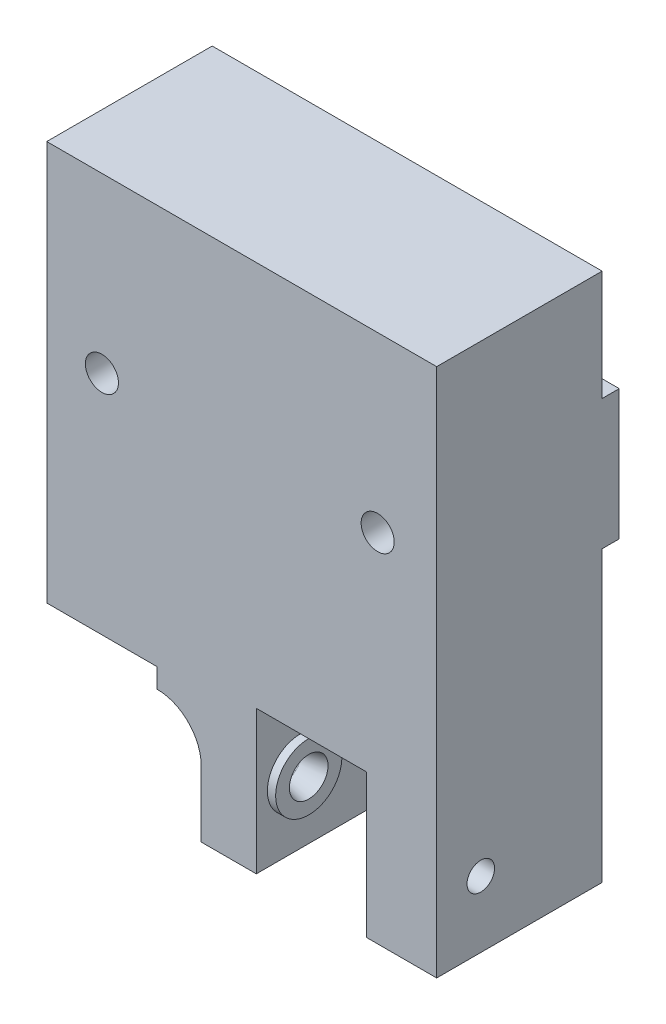
ISO-10303-21;
HEADER;
FILE_DESCRIPTION(('STEP AP214'),'2;1');
FILE_NAME('part.step','',(''),(''),'','','');
FILE_SCHEMA(('AUTOMOTIVE_DESIGN { 1 0 10303 214 1 1 1 1 }'));
ENDSEC;
DATA;
#1=APPLICATION_CONTEXT('core data for automotive mechanical design processes');
#2=APPLICATION_PROTOCOL_DEFINITION('international standard','automotive_design',2000,#1);
#3=PRODUCT_CONTEXT('',#1,'mechanical');
#4=PRODUCT('Part','Part','',(#3));
#5=PRODUCT_RELATED_PRODUCT_CATEGORY('part','',(#4));
#6=PRODUCT_DEFINITION_FORMATION('','',#4);
#7=PRODUCT_DEFINITION_CONTEXT('part definition',#1,'design');
#8=PRODUCT_DEFINITION('design','',#6,#7);
#9=PRODUCT_DEFINITION_SHAPE('','',#8);
#10=(LENGTH_UNIT() NAMED_UNIT(*) SI_UNIT(.MILLI.,.METRE.));
#11=(NAMED_UNIT(*) PLANE_ANGLE_UNIT() SI_UNIT($,.RADIAN.));
#12=(NAMED_UNIT(*) SI_UNIT($,.STERADIAN.) SOLID_ANGLE_UNIT());
#13=UNCERTAINTY_MEASURE_WITH_UNIT(LENGTH_MEASURE(1.E-05),#10,'distance_accuracy_value','');
#14=(GEOMETRIC_REPRESENTATION_CONTEXT(3) GLOBAL_UNCERTAINTY_ASSIGNED_CONTEXT((#13)) GLOBAL_UNIT_ASSIGNED_CONTEXT((#10,
#11,#12)) REPRESENTATION_CONTEXT('',''));
#15=CARTESIAN_POINT('',(0.,0.,0.));
#16=DIRECTION('',(0.,0.,1.));
#17=DIRECTION('',(1.,0.,0.));
#18=AXIS2_PLACEMENT_3D('',#15,#16,#17);
#19=CARTESIAN_POINT('',(66.,74.,0.));
#20=DIRECTION('',(0.,-1.,0.));
#21=DIRECTION('',(0.,0.,-1.));
#22=AXIS2_PLACEMENT_3D('',#19,#20,#21);
#23=PLANE('',#22);
#24=DIRECTION('',(-1.,0.,0.));
#25=VECTOR('',#24,1.);
#26=CARTESIAN_POINT('',(101.35,74.,0.));
#27=LINE('',#26,#25);
#28=CARTESIAN_POINT('',(101.35,74.,0.));
#29=VERTEX_POINT('',#28);
#30=CARTESIAN_POINT('',(66.,74.,0.));
#31=VERTEX_POINT('',#30);
#32=EDGE_CURVE('E138',#29,#31,#27,.T.);
#33=ORIENTED_EDGE('',*,*,#32,.F.);
#34=DIRECTION('',(0.,0.,-1.));
#35=VECTOR('',#34,1.);
#36=CARTESIAN_POINT('',(101.35,74.,0.));
#37=LINE('',#36,#35);
#38=CARTESIAN_POINT('',(101.35,74.,-1.55174270221973));
#39=VERTEX_POINT('',#38);
#40=EDGE_CURVE('E270',#29,#39,#37,.T.);
#41=ORIENTED_EDGE('',*,*,#40,.T.);
#42=DIRECTION('',(1.,0.,0.));
#43=VECTOR('',#42,1.);
#44=CARTESIAN_POINT('',(66.,74.,-1.55174270221973));
#45=LINE('',#44,#43);
#46=CARTESIAN_POINT('',(66.,74.,-1.55174270221973));
#47=VERTEX_POINT('',#46);
#48=EDGE_CURVE('E314',#47,#39,#45,.T.);
#49=ORIENTED_EDGE('',*,*,#48,.F.);
#50=DIRECTION('',(0.,0.,-1.));
#51=VECTOR('',#50,1.);
#52=CARTESIAN_POINT('',(66.,74.,0.));
#53=LINE('',#52,#51);
#54=EDGE_CURVE('E304',#31,#47,#53,.T.);
#55=ORIENTED_EDGE('',*,*,#54,.F.);
#56=EDGE_LOOP('',(#33,#41,#49,#55));
#57=FACE_BOUND('',#56,.T.);
#58=ADVANCED_FACE('F122',(#57),#23,.F.);
#59=CARTESIAN_POINT('',(7.,7.,15.));
#60=DIRECTION('',(0.,0.,1.));
#61=DIRECTION('',(1.,0.,0.));
#62=AXIS2_PLACEMENT_3D('',#59,#60,#61);
#63=PLANE('',#62);
#64=CARTESIAN_POINT('',(70.9999999999022,68.3,15.));
#65=DIRECTION('',(0.,0.,1.));
#66=DIRECTION('',(1.,0.,0.));
#67=AXIS2_PLACEMENT_3D('',#64,#65,#66);
#68=CIRCLE('',#67,1.5);
#69=CARTESIAN_POINT('',(72.4999999999022,68.3,15.));
#70=VERTEX_POINT('',#69);
#71=EDGE_CURVE('E283',#70,#70,#68,.T.);
#72=ORIENTED_EDGE('',*,*,#71,.F.);
#73=EDGE_LOOP('',(#72));
#74=FACE_BOUND('',#73,.T.);
#75=CARTESIAN_POINT('',(95.9999999999022,68.3,15.));
#76=DIRECTION('',(0.,0.,1.));
#77=DIRECTION('',(1.,0.,0.));
#78=AXIS2_PLACEMENT_3D('',#75,#76,#77);
#79=CIRCLE('',#78,1.5);
#80=CARTESIAN_POINT('',(97.4999999999022,68.3,15.));
#81=VERTEX_POINT('',#80);
#82=EDGE_CURVE('E271',#81,#81,#79,.T.);
#83=ORIENTED_EDGE('',*,*,#82,.F.);
#84=EDGE_LOOP('',(#83));
#85=FACE_BOUND('',#84,.T.);
#86=DIRECTION('',(0.,-1.,0.));
#87=VECTOR('',#86,1.);
#88=CARTESIAN_POINT('',(101.35,0.,15.));
#89=LINE('',#88,#87);
#90=CARTESIAN_POINT('',(101.35,84.,15.));
#91=VERTEX_POINT('',#90);
#92=CARTESIAN_POINT('',(101.35,36.,15.));
#93=VERTEX_POINT('',#92);
#94=EDGE_CURVE('E351',#91,#93,#89,.T.);
#95=ORIENTED_EDGE('',*,*,#94,.F.);
#96=DIRECTION('',(1.,0.,0.));
#97=VECTOR('',#96,1.);
#98=CARTESIAN_POINT('',(101.35,84.,15.));
#99=LINE('',#98,#97);
#100=CARTESIAN_POINT('',(66.,84.,15.));
#101=VERTEX_POINT('',#100);
#102=EDGE_CURVE('E264',#101,#91,#99,.T.);
#103=ORIENTED_EDGE('',*,*,#102,.F.);
#104=DIRECTION('',(0.,1.,0.));
#105=VECTOR('',#104,1.);
#106=CARTESIAN_POINT('',(66.,0.,15.));
#107=LINE('',#106,#105);
#108=CARTESIAN_POINT('',(66.,47.7679802880794,15.));
#109=VERTEX_POINT('',#108);
#110=EDGE_CURVE('E306',#109,#101,#107,.T.);
#111=ORIENTED_EDGE('',*,*,#110,.F.);
#112=DIRECTION('',(1.,0.,0.));
#113=VECTOR('',#112,1.);
#114=CARTESIAN_POINT('',(66.,47.7679802880794,15.));
#115=LINE('',#114,#113);
#116=CARTESIAN_POINT('',(76.,47.7679802880794,15.));
#117=VERTEX_POINT('',#116);
#118=EDGE_CURVE('E282',#109,#117,#115,.T.);
#119=ORIENTED_EDGE('',*,*,#118,.T.);
#120=DIRECTION('',(0.,-1.,0.));
#121=VECTOR('',#120,1.);
#122=CARTESIAN_POINT('',(76.,7.,15.));
#123=LINE('',#122,#121);
#124=CARTESIAN_POINT('',(76.,46.,15.));
#125=VERTEX_POINT('',#124);
#126=EDGE_CURVE('E339',#117,#125,#123,.T.);
#127=ORIENTED_EDGE('',*,*,#126,.T.);
#128=CARTESIAN_POINT('',(76.,42.,15.));
#129=DIRECTION('',(0.,0.,1.));
#130=DIRECTION('',(1.,0.,0.));
#131=AXIS2_PLACEMENT_3D('',#128,#129,#130);
#132=CIRCLE('',#131,4.);
#133=CARTESIAN_POINT('',(80.,42.,15.));
#134=VERTEX_POINT('',#133);
#135=EDGE_CURVE('E359',#125,#134,#132,.F.);
#136=ORIENTED_EDGE('',*,*,#135,.T.);
#137=DIRECTION('',(0.,1.,0.));
#138=VECTOR('',#137,1.);
#139=CARTESIAN_POINT('',(80.,46.,15.));
#140=LINE('',#139,#138);
#141=CARTESIAN_POINT('',(80.,36.,15.));
#142=VERTEX_POINT('',#141);
#143=EDGE_CURVE('E388',#142,#134,#140,.T.);
#144=ORIENTED_EDGE('',*,*,#143,.F.);
#145=DIRECTION('',(-1.,0.,0.));
#146=VECTOR('',#145,1.);
#147=CARTESIAN_POINT('',(101.35,36.,15.));
#148=LINE('',#147,#146);
#149=CARTESIAN_POINT('',(85.,36.,15.));
#150=VERTEX_POINT('',#149);
#151=EDGE_CURVE('E324',#150,#142,#148,.T.);
#152=ORIENTED_EDGE('',*,*,#151,.F.);
#153=DIRECTION('',(0.,1.,0.));
#154=VECTOR('',#153,1.);
#155=CARTESIAN_POINT('',(85.,32.,15.));
#156=LINE('',#155,#154);
#157=CARTESIAN_POINT('',(85.,49.,15.));
#158=VERTEX_POINT('',#157);
#159=EDGE_CURVE('E379',#150,#158,#156,.T.);
#160=ORIENTED_EDGE('',*,*,#159,.T.);
#161=DIRECTION('',(-1.,0.,0.));
#162=VECTOR('',#161,1.);
#163=CARTESIAN_POINT('',(95.,49.,15.));
#164=LINE('',#163,#162);
#165=CARTESIAN_POINT('',(95.,49.,15.));
#166=VERTEX_POINT('',#165);
#167=EDGE_CURVE('E366',#166,#158,#164,.T.);
#168=ORIENTED_EDGE('',*,*,#167,.F.);
#169=DIRECTION('',(0.,1.,0.));
#170=VECTOR('',#169,1.);
#171=CARTESIAN_POINT('',(95.,32.,15.));
#172=LINE('',#171,#170);
#173=CARTESIAN_POINT('',(95.,36.,15.));
#174=VERTEX_POINT('',#173);
#175=EDGE_CURVE('E412',#174,#166,#172,.T.);
#176=ORIENTED_EDGE('',*,*,#175,.F.);
#177=EDGE_CURVE('E325',#93,#174,#148,.T.);
#178=ORIENTED_EDGE('',*,*,#177,.F.);
#179=EDGE_LOOP('',(#95,#103,#111,#119,#127,#136,#144,#152,#160,#168,#176,#178));
#180=FACE_BOUND('',#179,.T.);
#181=ADVANCED_FACE('F124',(#74,#85,#180),#63,.T.);
#182=CARTESIAN_POINT('',(7.,7.,0.));
#183=DIRECTION('',(0.,0.,-1.));
#184=DIRECTION('',(-1.,0.,0.));
#185=AXIS2_PLACEMENT_3D('',#182,#183,#184);
#186=PLANE('',#185);
#187=DIRECTION('',(1.,0.,0.));
#188=VECTOR('',#187,1.);
#189=CARTESIAN_POINT('',(66.,47.7679802880794,0.));
#190=LINE('',#189,#188);
#191=CARTESIAN_POINT('',(66.,47.7679802880794,0.));
#192=VERTEX_POINT('',#191);
#193=CARTESIAN_POINT('',(76.,47.7679802880794,0.));
#194=VERTEX_POINT('',#193);
#195=EDGE_CURVE('E290',#192,#194,#190,.T.);
#196=ORIENTED_EDGE('',*,*,#195,.F.);
#197=DIRECTION('',(0.,-1.,0.));
#198=VECTOR('',#197,1.);
#199=CARTESIAN_POINT('',(66.,0.,0.));
#200=LINE('',#199,#198);
#201=CARTESIAN_POINT('',(66.,62.2,0.));
#202=VERTEX_POINT('',#201);
#203=EDGE_CURVE('E298',#202,#192,#200,.T.);
#204=ORIENTED_EDGE('',*,*,#203,.F.);
#205=DIRECTION('',(1.,0.,0.));
#206=VECTOR('',#205,1.);
#207=CARTESIAN_POINT('',(66.,62.2,0.));
#208=LINE('',#207,#206);
#209=CARTESIAN_POINT('',(101.35,62.2,0.));
#210=VERTEX_POINT('',#209);
#211=EDGE_CURVE('E308',#202,#210,#208,.T.);
#212=ORIENTED_EDGE('',*,*,#211,.T.);
#213=DIRECTION('',(0.,-1.,0.));
#214=VECTOR('',#213,1.);
#215=CARTESIAN_POINT('',(101.35,0.,0.));
#216=LINE('',#215,#214);
#217=CARTESIAN_POINT('',(101.35,36.,0.));
#218=VERTEX_POINT('',#217);
#219=EDGE_CURVE('E353',#210,#218,#216,.T.);
#220=ORIENTED_EDGE('',*,*,#219,.T.);
#221=DIRECTION('',(1.,0.,0.));
#222=VECTOR('',#221,1.);
#223=CARTESIAN_POINT('',(101.35,36.,0.));
#224=LINE('',#223,#222);
#225=CARTESIAN_POINT('',(80.,36.,0.));
#226=VERTEX_POINT('',#225);
#227=EDGE_CURVE('E146',#226,#218,#224,.T.);
#228=ORIENTED_EDGE('',*,*,#227,.F.);
#229=DIRECTION('',(0.,1.,0.));
#230=VECTOR('',#229,1.);
#231=CARTESIAN_POINT('',(80.,7.,0.));
#232=LINE('',#231,#230);
#233=CARTESIAN_POINT('',(80.,42.,0.));
#234=VERTEX_POINT('',#233);
#235=EDGE_CURVE('E384',#226,#234,#232,.T.);
#236=ORIENTED_EDGE('',*,*,#235,.T.);
#237=CARTESIAN_POINT('',(76.,42.,0.));
#238=DIRECTION('',(0.,0.,-1.));
#239=DIRECTION('',(-1.,0.,0.));
#240=AXIS2_PLACEMENT_3D('',#237,#238,#239);
#241=CIRCLE('',#240,4.);
#242=CARTESIAN_POINT('',(76.,46.,0.));
#243=VERTEX_POINT('',#242);
#244=EDGE_CURVE('E380',#234,#243,#241,.F.);
#245=ORIENTED_EDGE('',*,*,#244,.T.);
#246=DIRECTION('',(0.,-1.,0.));
#247=VECTOR('',#246,1.);
#248=CARTESIAN_POINT('',(76.,53.,0.));
#249=LINE('',#248,#247);
#250=EDGE_CURVE('E337',#194,#243,#249,.T.);
#251=ORIENTED_EDGE('',*,*,#250,.F.);
#252=EDGE_LOOP('',(#196,#204,#212,#220,#228,#236,#245,#251));
#253=FACE_BOUND('',#252,.T.);
#254=ADVANCED_FACE('F475',(#253),#186,.T.);
#255=CARTESIAN_POINT('',(80.,46.,-40.2965719651132));
#256=DIRECTION('',(-1.,0.,0.));
#257=DIRECTION('',(0.,0.,1.));
#258=AXIS2_PLACEMENT_3D('',#255,#256,#257);
#259=PLANE('',#258);
#260=ORIENTED_EDGE('',*,*,#235,.F.);
#261=DIRECTION('',(0.,0.,-1.));
#262=VECTOR('',#261,1.);
#263=CARTESIAN_POINT('',(80.,36.,0.));
#264=LINE('',#263,#262);
#265=EDGE_CURVE('E327',#142,#226,#264,.T.);
#266=ORIENTED_EDGE('',*,*,#265,.F.);
#267=ORIENTED_EDGE('',*,*,#143,.T.);
#268=DIRECTION('',(0.,0.,-1.));
#269=VECTOR('',#268,1.);
#270=CARTESIAN_POINT('',(80.,42.,0.));
#271=LINE('',#270,#269);
#272=CARTESIAN_POINT('',(80.,42.,13.75));
#273=VERTEX_POINT('',#272);
#274=EDGE_CURVE('E385',#134,#273,#271,.T.);
#275=ORIENTED_EDGE('',*,*,#274,.T.);
#276=CARTESIAN_POINT('',(80.,42.,11.));
#277=DIRECTION('',(-1.,0.,0.));
#278=DIRECTION('',(0.,0.,1.));
#279=AXIS2_PLACEMENT_3D('',#276,#277,#278);
#280=CIRCLE('',#279,2.75);
#281=CARTESIAN_POINT('',(80.,42.,8.25));
#282=VERTEX_POINT('',#281);
#283=EDGE_CURVE('E344',#273,#282,#280,.F.);
#284=ORIENTED_EDGE('',*,*,#283,.T.);
#285=DIRECTION('',(0.,0.,-1.));
#286=VECTOR('',#285,1.);
#287=CARTESIAN_POINT('',(80.,42.,0.));
#288=LINE('',#287,#286);
#289=EDGE_CURVE('E376',#282,#234,#288,.T.);
#290=ORIENTED_EDGE('',*,*,#289,.T.);
#291=EDGE_LOOP('',(#260,#266,#267,#275,#284,#290));
#292=FACE_BOUND('',#291,.T.);
#293=ADVANCED_FACE('F542',(#292),#259,.T.);
#294=CARTESIAN_POINT('',(95.,42.,12.));
#295=DIRECTION('',(-1.,0.,0.));
#296=DIRECTION('',(0.,0.,1.));
#297=AXIS2_PLACEMENT_3D('',#294,#295,#296);
#298=CYLINDRICAL_SURFACE('',#297,10.);
#299=DIRECTION('',(-1.,0.,0.));
#300=VECTOR('',#299,1.);
#301=CARTESIAN_POINT('',(95.,36.,4.));
#302=LINE('',#301,#300);
#303=CARTESIAN_POINT('',(95.,36.,4.));
#304=VERTEX_POINT('',#303);
#305=CARTESIAN_POINT('',(85.,36.,4.));
#306=VERTEX_POINT('',#305);
#307=EDGE_CURVE('E332',#304,#306,#302,.T.);
#308=ORIENTED_EDGE('',*,*,#307,.F.);
#309=CARTESIAN_POINT('',(95.,42.,12.));
#310=DIRECTION('',(-1.,0.,0.));
#311=DIRECTION('',(0.,0.,1.));
#312=AXIS2_PLACEMENT_3D('',#309,#310,#311);
#313=CIRCLE('',#312,10.);
#314=CARTESIAN_POINT('',(95.,42.,2.));
#315=VERTEX_POINT('',#314);
#316=EDGE_CURVE('E362',#315,#304,#313,.T.);
#317=ORIENTED_EDGE('',*,*,#316,.F.);
#318=DIRECTION('',(-1.,0.,0.));
#319=VECTOR('',#318,1.);
#320=CARTESIAN_POINT('',(95.,42.,2.));
#321=LINE('',#320,#319);
#322=CARTESIAN_POINT('',(85.,42.,2.));
#323=VERTEX_POINT('',#322);
#324=EDGE_CURVE('E372',#315,#323,#321,.T.);
#325=ORIENTED_EDGE('',*,*,#324,.T.);
#326=CARTESIAN_POINT('',(85.,42.,12.));
#327=DIRECTION('',(-1.,0.,0.));
#328=DIRECTION('',(0.,0.,1.));
#329=AXIS2_PLACEMENT_3D('',#326,#327,#328);
#330=CIRCLE('',#329,10.);
#331=EDGE_CURVE('E375',#323,#306,#330,.T.);
#332=ORIENTED_EDGE('',*,*,#331,.T.);
#333=EDGE_LOOP('',(#308,#317,#325,#332));
#334=FACE_BOUND('',#333,.T.);
#335=ADVANCED_FACE('F535',(#334),#298,.F.);
#336=CARTESIAN_POINT('',(95.,42.,12.));
#337=DIRECTION('',(-1.,0.,0.));
#338=DIRECTION('',(0.,0.,1.));
#339=AXIS2_PLACEMENT_3D('',#336,#337,#338);
#340=PLANE('',#339);
#341=CARTESIAN_POINT('',(95.,42.,11.));
#342=DIRECTION('',(-1.,0.,0.));
#343=DIRECTION('',(0.,0.,1.));
#344=AXIS2_PLACEMENT_3D('',#341,#342,#343);
#345=CIRCLE('',#344,3.);
#346=CARTESIAN_POINT('',(95.,42.,14.));
#347=VERTEX_POINT('',#346);
#348=EDGE_CURVE('E400',#347,#347,#345,.T.);
#349=ORIENTED_EDGE('',*,*,#348,.F.);
#350=EDGE_LOOP('',(#349));
#351=FACE_BOUND('',#350,.T.);
#352=ORIENTED_EDGE('',*,*,#316,.T.);
#353=DIRECTION('',(0.,0.,1.));
#354=VECTOR('',#353,1.);
#355=CARTESIAN_POINT('',(95.,36.,12.));
#356=LINE('',#355,#354);
#357=EDGE_CURVE('E334',#304,#174,#356,.T.);
#358=ORIENTED_EDGE('',*,*,#357,.T.);
#359=ORIENTED_EDGE('',*,*,#175,.T.);
#360=DIRECTION('',(0.,0.,-1.));
#361=VECTOR('',#360,1.);
#362=CARTESIAN_POINT('',(95.,49.,15.));
#363=LINE('',#362,#361);
#364=CARTESIAN_POINT('',(95.,49.,9.));
#365=VERTEX_POINT('',#364);
#366=EDGE_CURVE('E363',#166,#365,#363,.T.);
#367=ORIENTED_EDGE('',*,*,#366,.T.);
#368=CARTESIAN_POINT('',(95.,42.,9.));
#369=DIRECTION('',(-1.,0.,0.));
#370=DIRECTION('',(0.,0.,1.));
#371=AXIS2_PLACEMENT_3D('',#368,#369,#370);
#372=CIRCLE('',#371,7.);
#373=EDGE_CURVE('E360',#365,#315,#372,.T.);
#374=ORIENTED_EDGE('',*,*,#373,.T.);
#375=EDGE_LOOP('',(#352,#358,#359,#367,#374));
#376=FACE_BOUND('',#375,.T.);
#377=ADVANCED_FACE('F526',(#351,#376),#340,.T.);
#378=CARTESIAN_POINT('',(85.,42.,12.));
#379=DIRECTION('',(-1.,0.,0.));
#380=DIRECTION('',(0.,0.,1.));
#381=AXIS2_PLACEMENT_3D('',#378,#379,#380);
#382=PLANE('',#381);
#383=CARTESIAN_POINT('',(85.,42.,11.));
#384=DIRECTION('',(-1.,0.,0.));
#385=DIRECTION('',(0.,0.,1.));
#386=AXIS2_PLACEMENT_3D('',#383,#384,#385);
#387=CIRCLE('',#386,3.);
#388=CARTESIAN_POINT('',(85.,42.,14.));
#389=VERTEX_POINT('',#388);
#390=EDGE_CURVE('E371',#389,#389,#387,.T.);
#391=ORIENTED_EDGE('',*,*,#390,.T.);
#392=EDGE_LOOP('',(#391));
#393=FACE_BOUND('',#392,.T.);
#394=DIRECTION('',(0.,0.,1.));
#395=VECTOR('',#394,1.);
#396=CARTESIAN_POINT('',(85.,36.,12.));
#397=LINE('',#396,#395);
#398=EDGE_CURVE('E330',#306,#150,#397,.T.);
#399=ORIENTED_EDGE('',*,*,#398,.F.);
#400=ORIENTED_EDGE('',*,*,#331,.F.);
#401=CARTESIAN_POINT('',(85.,42.,9.));
#402=DIRECTION('',(-1.,0.,0.));
#403=DIRECTION('',(0.,0.,1.));
#404=AXIS2_PLACEMENT_3D('',#401,#402,#403);
#405=CIRCLE('',#404,7.);
#406=CARTESIAN_POINT('',(85.,49.,9.));
#407=VERTEX_POINT('',#406);
#408=EDGE_CURVE('E368',#323,#407,#405,.F.);
#409=ORIENTED_EDGE('',*,*,#408,.T.);
#410=DIRECTION('',(0.,0.,-1.));
#411=VECTOR('',#410,1.);
#412=CARTESIAN_POINT('',(85.,49.,15.));
#413=LINE('',#412,#411);
#414=EDGE_CURVE('E367',#158,#407,#413,.T.);
#415=ORIENTED_EDGE('',*,*,#414,.F.);
#416=ORIENTED_EDGE('',*,*,#159,.F.);
#417=EDGE_LOOP('',(#399,#400,#409,#415,#416));
#418=FACE_BOUND('',#417,.T.);
#419=ADVANCED_FACE('F456',(#393,#418),#382,.F.);
#420=CARTESIAN_POINT('',(101.35,0.,-54.0744076132316));
#421=DIRECTION('',(-1.,0.,0.));
#422=DIRECTION('',(0.,0.,1.));
#423=AXIS2_PLACEMENT_3D('',#420,#421,#422);
#424=PLANE('',#423);
#425=CARTESIAN_POINT('',(101.35,42.,11.));
#426=DIRECTION('',(-1.,0.,0.));
#427=DIRECTION('',(0.,0.,1.));
#428=AXIS2_PLACEMENT_3D('',#425,#426,#427);
#429=CIRCLE('',#428,1.24999999999999);
#430=CARTESIAN_POINT('',(101.35,42.,12.25));
#431=VERTEX_POINT('',#430);
#432=EDGE_CURVE('E347',#431,#431,#429,.F.);
#433=ORIENTED_EDGE('',*,*,#432,.F.);
#434=EDGE_LOOP('',(#433));
#435=FACE_BOUND('',#434,.T.);
#436=DIRECTION('',(0.,0.,1.));
#437=VECTOR('',#436,1.);
#438=CARTESIAN_POINT('',(101.35,36.,0.));
#439=LINE('',#438,#437);
#440=EDGE_CURVE('E317',#218,#93,#439,.T.);
#441=ORIENTED_EDGE('',*,*,#440,.F.);
#442=ORIENTED_EDGE('',*,*,#219,.F.);
#443=DIRECTION('',(0.,0.,1.));
#444=VECTOR('',#443,1.);
#445=CARTESIAN_POINT('',(101.35,62.2,0.));
#446=LINE('',#445,#444);
#447=CARTESIAN_POINT('',(101.35,62.2,-1.55174270221973));
#448=VERTEX_POINT('',#447);
#449=EDGE_CURVE('E297',#448,#210,#446,.T.);
#450=ORIENTED_EDGE('',*,*,#449,.F.);
#451=DIRECTION('',(0.,-1.,0.));
#452=VECTOR('',#451,1.);
#453=CARTESIAN_POINT('',(101.35,0.,-1.55174270221974));
#454=LINE('',#453,#452);
#455=EDGE_CURVE('E311',#39,#448,#454,.T.);
#456=ORIENTED_EDGE('',*,*,#455,.F.);
#457=ORIENTED_EDGE('',*,*,#40,.F.);
#458=DIRECTION('',(0.,-1.,0.));
#459=VECTOR('',#458,1.);
#460=CARTESIAN_POINT('',(101.35,84.,0.));
#461=LINE('',#460,#459);
#462=CARTESIAN_POINT('',(101.35,84.,0.));
#463=VERTEX_POINT('',#462);
#464=EDGE_CURVE('E251',#463,#29,#461,.T.);
#465=ORIENTED_EDGE('',*,*,#464,.F.);
#466=DIRECTION('',(0.,0.,-1.));
#467=VECTOR('',#466,1.);
#468=CARTESIAN_POINT('',(101.35,84.,15.));
#469=LINE('',#468,#467);
#470=EDGE_CURVE('E258',#91,#463,#469,.T.);
#471=ORIENTED_EDGE('',*,*,#470,.F.);
#472=ORIENTED_EDGE('',*,*,#94,.T.);
#473=EDGE_LOOP('',(#441,#442,#450,#456,#457,#465,#471,#472));
#474=FACE_BOUND('',#473,.T.);
#475=ADVANCED_FACE('F268',(#435,#474),#424,.F.);
#476=CARTESIAN_POINT('',(85.75,42.,11.));
#477=DIRECTION('',(1.,0.,0.));
#478=DIRECTION('',(0.,0.,-1.));
#479=AXIS2_PLACEMENT_3D('',#476,#477,#478);
#480=CYLINDRICAL_SURFACE('',#479,1.24999999999999);
#481=CARTESIAN_POINT('',(83.7500000000375,42.,11.));
#482=DIRECTION('',(1.,0.,0.));
#483=DIRECTION('',(0.,0.,-1.));
#484=AXIS2_PLACEMENT_3D('',#481,#482,#483);
#485=CIRCLE('',#484,1.24999999999999);
#486=CARTESIAN_POINT('',(83.7500000000375,42.,9.75000000000001));
#487=VERTEX_POINT('',#486);
#488=EDGE_CURVE('E396',#487,#487,#485,.T.);
#489=ORIENTED_EDGE('',*,*,#488,.T.);
#490=EDGE_LOOP('',(#489));
#491=FACE_BOUND('',#490,.T.);
#492=CARTESIAN_POINT('',(81.5,42.,11.));
#493=DIRECTION('',(-1.,0.,0.));
#494=DIRECTION('',(0.,0.,1.));
#495=AXIS2_PLACEMENT_3D('',#492,#493,#494);
#496=CIRCLE('',#495,1.24999999999999);
#497=CARTESIAN_POINT('',(81.5,42.,12.25));
#498=VERTEX_POINT('',#497);
#499=EDGE_CURVE('E126',#498,#498,#496,.F.);
#500=ORIENTED_EDGE('',*,*,#499,.F.);
#501=EDGE_LOOP('',(#500));
#502=FACE_BOUND('',#501,.T.);
#503=ADVANCED_FACE('F455',(#491,#502),#480,.F.);
#504=CARTESIAN_POINT('',(76.,42.,-40.2965719651132));
#505=DIRECTION('',(0.,0.,1.));
#506=DIRECTION('',(1.,0.,0.));
#507=AXIS2_PLACEMENT_3D('',#504,#505,#506);
#508=CYLINDRICAL_SURFACE('',#507,4.);
#509=CARTESIAN_POINT('',(80.,42.,13.75));
#510=CARTESIAN_POINT('',(80.0000149846027,42.0689004225931,13.7500137630055));
#511=CARTESIAN_POINT('',(79.998220225474,42.1377904237434,13.747411040131));
#512=CARTESIAN_POINT('',(79.9911248002035,42.274963861058,13.7370792666875));
#513=CARTESIAN_POINT('',(79.9858261908266,42.3432476292658,13.7293532235072));
#514=CARTESIAN_POINT('',(79.9718802667572,42.4782802355573,13.7089454168522));
#515=CARTESIAN_POINT('',(79.9632541608216,42.5450360140288,13.6962950354997));
#516=CARTESIAN_POINT('',(79.9428646541904,42.6769645115727,13.6662337258877));
#517=CARTESIAN_POINT('',(79.9311009413613,42.7421370724401,13.6488223239907));
#518=CARTESIAN_POINT('',(79.8915286672738,42.9343657108511,13.5898569658519));
#519=CARTESIAN_POINT('',(79.8593957685753,43.0585294597571,13.5415102141249));
#520=CARTESIAN_POINT('',(79.7861180746453,43.2964903391448,13.4287897679753));
#521=CARTESIAN_POINT('',(79.7449614382898,43.4102735676594,13.3643949997183));
#522=CARTESIAN_POINT('',(79.6526377906242,43.6353174187805,13.215397602273));
#523=CARTESIAN_POINT('',(79.600912741717,43.7455078325246,13.1295285460098));
#524=CARTESIAN_POINT('',(79.4939139574322,43.9509004496866,12.943132241776));
#525=CARTESIAN_POINT('',(79.4386355176318,44.0460821824826,12.8425853280358));
#526=CARTESIAN_POINT('',(79.3193336173123,44.2352898177603,12.6100095078434));
#527=CARTESIAN_POINT('',(79.255413682523,44.3263930979707,12.475532532518));
#528=CARTESIAN_POINT('',(79.1362562941311,44.4846935682904,12.1896964244467));
#529=CARTESIAN_POINT('',(79.0810040110478,44.5519318435351,12.0383669005022));
#530=CARTESIAN_POINT('',(79.0029843544403,44.6428268903308,11.7691368725407));
#531=CARTESIAN_POINT('',(78.9754468505128,44.6735161729974,11.6550089227581));
#532=CARTESIAN_POINT('',(78.9329406279653,44.7200871978373,11.4215796037558));
#533=CARTESIAN_POINT('',(78.9179486552619,44.7359963421674,11.3022882390965));
#534=CARTESIAN_POINT('',(78.9028774133127,44.7519890880539,11.0610520103045));
#535=CARTESIAN_POINT('',(78.902873860881,44.7519923380169,10.9390967857921));
#536=CARTESIAN_POINT('',(78.9179770500878,44.7359667222856,10.6971651464078));
#537=CARTESIAN_POINT('',(78.9330945905605,44.7199263989614,10.5771902080149));
#538=CARTESIAN_POINT('',(78.9747109413773,44.6743150620638,10.3494028943497));
#539=CARTESIAN_POINT('',(79.0005073611582,44.6455727352502,10.2412875906034));
#540=CARTESIAN_POINT('',(79.0603248234008,44.5761428094307,10.0313772375628));
#541=CARTESIAN_POINT('',(79.094352241273,44.5354459456426,9.92958716473739));
#542=CARTESIAN_POINT('',(79.186190853016,44.4199180681051,9.68349438593371));
#543=CARTESIAN_POINT('',(79.2473419534719,44.338223462827,9.5436422262892));
#544=CARTESIAN_POINT('',(79.3732344035183,44.1526527165283,9.28113631459432));
#545=CARTESIAN_POINT('',(79.4379824946339,44.0487338078194,9.15851648867305));
#546=CARTESIAN_POINT('',(79.5648882251214,43.8190567200535,8.9312151698465));
#547=CARTESIAN_POINT('',(79.6270147763365,43.6930971553458,8.82671852191538));
#548=CARTESIAN_POINT('',(79.7416971137258,43.421719928059,8.64030067766726));
#549=CARTESIAN_POINT('',(79.7942708524984,43.2763396743945,8.55833698323039));
#550=CARTESIAN_POINT('',(79.8741558766237,43.0032346719072,8.43617475919771));
#551=CARTESIAN_POINT('',(79.9044829975357,42.8787222067539,8.39074770557505));
#552=CARTESIAN_POINT('',(79.9534204637276,42.6223952438991,8.3180665337416));
#553=CARTESIAN_POINT('',(79.9720550511347,42.4905964747631,8.29077480857314));
#554=CARTESIAN_POINT('',(79.9893274938476,42.2980124293635,8.26554245229437));
#555=CARTESIAN_POINT('',(79.993321545072,42.2386238130935,8.25972135130718));
#556=CARTESIAN_POINT('',(79.9986586234799,42.119500450775,8.25195039538953));
#557=CARTESIAN_POINT('',(80.0000027439929,42.0597658576793,8.24999894388638));
#558=CARTESIAN_POINT('',(80.,42.,8.24999999999992));
#559=B_SPLINE_CURVE_WITH_KNOTS('',3,(#509,#510,#511,#512,#513,#514,#515,#516,#517,#518,#519,
#520,#521,#522,#523,#524,#525,#526,#527,#528,#529,#530,#531,#532,#533,#534,#535,#536,#537,#538,
#539,#540,#541,#542,#543,#544,#545,#546,#547,#548,#549,#550,#551,#552,#553,#554,#555,#556,#557,
#558),.UNSPECIFIED.,.F.,.F.,(4,2,2,2,2,2,2,2,2,2,2,2,2,2,2,2,2,2,2,2,2,2,2,2,4),(0.,
0.206611673394902,0.413102172986078,0.618297731000984,0.823513709782065,1.23274986581742,
1.64252627817105,2.08776032203823,2.53359647216342,3.05489658496506,3.57529484277058,
3.93793981088165,4.29991109098696,4.66371093467637,5.02777077420289,5.37095309199489,
5.71440208143015,6.23106706666505,6.74873539748295,7.27140742081738,7.79308679163179,
8.19932254669956,8.60471324583915,8.7839769779217,8.96316673245692),.UNSPECIFIED.);
#560=EDGE_CURVE('E12',#273,#282,#559,.T.);
#561=ORIENTED_EDGE('',*,*,#560,.F.);
#562=ORIENTED_EDGE('',*,*,#274,.F.);
#563=ORIENTED_EDGE('',*,*,#135,.F.);
#564=DIRECTION('',(0.,0.,-1.));
#565=VECTOR('',#564,1.);
#566=CARTESIAN_POINT('',(76.,46.,15.));
#567=LINE('',#566,#565);
#568=EDGE_CURVE('E383',#243,#125,#567,.F.);
#569=ORIENTED_EDGE('',*,*,#568,.F.);
#570=ORIENTED_EDGE('',*,*,#244,.F.);
#571=ORIENTED_EDGE('',*,*,#289,.F.);
#572=EDGE_LOOP('',(#561,#562,#563,#569,#570,#571));
#573=FACE_BOUND('',#572,.T.);
#574=ADVANCED_FACE('F435',(#573),#508,.F.);
#575=CARTESIAN_POINT('',(95.,49.,15.));
#576=DIRECTION('',(0.,1.,0.));
#577=DIRECTION('',(0.,0.,1.));
#578=AXIS2_PLACEMENT_3D('',#575,#576,#577);
#579=PLANE('',#578);
#580=ORIENTED_EDGE('',*,*,#414,.T.);
#581=DIRECTION('',(1.,0.,0.));
#582=VECTOR('',#581,1.);
#583=CARTESIAN_POINT('',(95.,49.,9.));
#584=LINE('',#583,#582);
#585=EDGE_CURVE('E364',#407,#365,#584,.T.);
#586=ORIENTED_EDGE('',*,*,#585,.T.);
#587=ORIENTED_EDGE('',*,*,#366,.F.);
#588=ORIENTED_EDGE('',*,*,#167,.T.);
#589=EDGE_LOOP('',(#580,#586,#587,#588));
#590=FACE_BOUND('',#589,.T.);
#591=ADVANCED_FACE('F528',(#590),#579,.F.);
#592=CARTESIAN_POINT('',(94.25,42.,11.));
#593=DIRECTION('',(1.,0.,0.));
#594=DIRECTION('',(0.,0.,-1.));
#595=AXIS2_PLACEMENT_3D('',#592,#593,#594);
#596=CYLINDRICAL_SURFACE('',#595,3.);
#597=CARTESIAN_POINT('',(94.25,42.,11.));
#598=DIRECTION('',(1.,0.,0.));
#599=DIRECTION('',(0.,0.,-1.));
#600=AXIS2_PLACEMENT_3D('',#597,#598,#599);
#601=CIRCLE('',#600,3.);
#602=CARTESIAN_POINT('',(94.25,42.,8.));
#603=VERTEX_POINT('',#602);
#604=EDGE_CURVE('E370',#603,#603,#601,.T.);
#605=ORIENTED_EDGE('',*,*,#604,.T.);
#606=EDGE_LOOP('',(#605));
#607=FACE_BOUND('',#606,.T.);
#608=ORIENTED_EDGE('',*,*,#348,.T.);
#609=EDGE_LOOP('',(#608));
#610=FACE_BOUND('',#609,.T.);
#611=ADVANCED_FACE('F574',(#607,#610),#596,.T.);
#612=CARTESIAN_POINT('',(94.25,45.,11.));
#613=DIRECTION('',(-1.,0.,0.));
#614=DIRECTION('',(0.,0.,1.));
#615=AXIS2_PLACEMENT_3D('',#612,#613,#614);
#616=PLANE('',#615);
#617=CARTESIAN_POINT('',(94.25,42.,11.));
#618=DIRECTION('',(-1.,0.,0.));
#619=DIRECTION('',(0.,0.,1.));
#620=AXIS2_PLACEMENT_3D('',#617,#618,#619);
#621=CIRCLE('',#620,1.50000000000001);
#622=CARTESIAN_POINT('',(94.25,42.,12.5));
#623=VERTEX_POINT('',#622);
#624=EDGE_CURVE('E131',#623,#623,#621,.T.);
#625=ORIENTED_EDGE('',*,*,#624,.F.);
#626=EDGE_LOOP('',(#625));
#627=FACE_BOUND('',#626,.T.);
#628=ORIENTED_EDGE('',*,*,#604,.F.);
#629=EDGE_LOOP('',(#628));
#630=FACE_BOUND('',#629,.T.);
#631=ADVANCED_FACE('F571',(#627,#630),#616,.T.);
#632=CARTESIAN_POINT('',(85.75,42.,11.));
#633=DIRECTION('',(-1.,0.,0.));
#634=DIRECTION('',(0.,0.,1.));
#635=AXIS2_PLACEMENT_3D('',#632,#633,#634);
#636=CYLINDRICAL_SURFACE('',#635,3.);
#637=CARTESIAN_POINT('',(85.75,42.,11.));
#638=DIRECTION('',(-1.,0.,0.));
#639=DIRECTION('',(0.,0.,1.));
#640=AXIS2_PLACEMENT_3D('',#637,#638,#639);
#641=CIRCLE('',#640,3.);
#642=CARTESIAN_POINT('',(85.75,42.,14.));
#643=VERTEX_POINT('',#642);
#644=EDGE_CURVE('E397',#643,#643,#641,.T.);
#645=ORIENTED_EDGE('',*,*,#644,.T.);
#646=EDGE_LOOP('',(#645));
#647=FACE_BOUND('',#646,.T.);
#648=ORIENTED_EDGE('',*,*,#390,.F.);
#649=EDGE_LOOP('',(#648));
#650=FACE_BOUND('',#649,.T.);
#651=ADVANCED_FACE('F565',(#647,#650),#636,.T.);
#652=CARTESIAN_POINT('',(85.75,45.,11.));
#653=DIRECTION('',(1.,0.,0.));
#654=DIRECTION('',(0.,0.,-1.));
#655=AXIS2_PLACEMENT_3D('',#652,#653,#654);
#656=PLANE('',#655);
#657=CARTESIAN_POINT('',(85.75,42.,11.));
#658=DIRECTION('',(1.,0.,0.));
#659=DIRECTION('',(0.,0.,-1.));
#660=AXIS2_PLACEMENT_3D('',#657,#658,#659);
#661=CIRCLE('',#660,1.74999999999063);
#662=CARTESIAN_POINT('',(85.75,42.,9.25000000000937));
#663=VERTEX_POINT('',#662);
#664=EDGE_CURVE('E393',#663,#663,#661,.F.);
#665=ORIENTED_EDGE('',*,*,#664,.T.);
#666=EDGE_LOOP('',(#665));
#667=FACE_BOUND('',#666,.T.);
#668=ORIENTED_EDGE('',*,*,#644,.F.);
#669=EDGE_LOOP('',(#668));
#670=FACE_BOUND('',#669,.T.);
#671=ADVANCED_FACE('F558',(#667,#670),#656,.T.);
#672=CARTESIAN_POINT('',(100.,42.,11.));
#673=DIRECTION('',(1.,0.,0.));
#674=DIRECTION('',(0.,0.,-1.));
#675=AXIS2_PLACEMENT_3D('',#672,#673,#674);
#676=CYLINDRICAL_SURFACE('',#675,1.50000000000001);
#677=CARTESIAN_POINT('',(95.,42.,11.));
#678=DIRECTION('',(-1.,0.,0.));
#679=DIRECTION('',(0.,0.,1.));
#680=AXIS2_PLACEMENT_3D('',#677,#678,#679);
#681=CIRCLE('',#680,1.50000000000001);
#682=CARTESIAN_POINT('',(95.,42.,12.5));
#683=VERTEX_POINT('',#682);
#684=EDGE_CURVE('E356',#683,#683,#681,.F.);
#685=ORIENTED_EDGE('',*,*,#684,.T.);
#686=EDGE_LOOP('',(#685));
#687=FACE_BOUND('',#686,.T.);
#688=ORIENTED_EDGE('',*,*,#624,.T.);
#689=EDGE_LOOP('',(#688));
#690=FACE_BOUND('',#689,.T.);
#691=ADVANCED_FACE('F467',(#687,#690),#676,.F.);
#692=CARTESIAN_POINT('',(83.7500000000375,42.,11.));
#693=DIRECTION('',(1.,0.,0.));
#694=DIRECTION('',(0.,0.,-1.));
#695=AXIS2_PLACEMENT_3D('',#692,#693,#694);
#696=CONICAL_SURFACE('',#695,1.24999999999999,0.244978663126864);
#697=ORIENTED_EDGE('',*,*,#664,.F.);
#698=EDGE_LOOP('',(#697));
#699=FACE_BOUND('',#698,.T.);
#700=ORIENTED_EDGE('',*,*,#488,.F.);
#701=EDGE_LOOP('',(#700));
#702=FACE_BOUND('',#701,.T.);
#703=ADVANCED_FACE('F462',(#699,#702),#696,.F.);
#704=CARTESIAN_POINT('',(95.,42.,9.));
#705=DIRECTION('',(-1.,0.,0.));
#706=DIRECTION('',(0.,0.,1.));
#707=AXIS2_PLACEMENT_3D('',#704,#705,#706);
#708=CYLINDRICAL_SURFACE('',#707,7.);
#709=ORIENTED_EDGE('',*,*,#373,.F.);
#710=ORIENTED_EDGE('',*,*,#585,.F.);
#711=ORIENTED_EDGE('',*,*,#408,.F.);
#712=ORIENTED_EDGE('',*,*,#324,.F.);
#713=EDGE_LOOP('',(#709,#710,#711,#712));
#714=FACE_BOUND('',#713,.T.);
#715=ADVANCED_FACE('F459',(#714),#708,.F.);
#716=CARTESIAN_POINT('',(95.,0.,-54.0744076132316));
#717=DIRECTION('',(-1.,0.,0.));
#718=DIRECTION('',(0.,0.,1.));
#719=AXIS2_PLACEMENT_3D('',#716,#717,#718);
#720=PLANE('',#719);
#721=CARTESIAN_POINT('',(95.,42.,11.));
#722=DIRECTION('',(-1.,0.,0.));
#723=DIRECTION('',(0.,0.,1.));
#724=AXIS2_PLACEMENT_3D('',#721,#722,#723);
#725=CIRCLE('',#724,1.24999999999999);
#726=CARTESIAN_POINT('',(95.,42.,12.25));
#727=VERTEX_POINT('',#726);
#728=EDGE_CURVE('E350',#727,#727,#725,.T.);
#729=ORIENTED_EDGE('',*,*,#728,.F.);
#730=EDGE_LOOP('',(#729));
#731=FACE_BOUND('',#730,.T.);
#732=ORIENTED_EDGE('',*,*,#684,.F.);
#733=EDGE_LOOP('',(#732));
#734=FACE_BOUND('',#733,.T.);
#735=ADVANCED_FACE('F451',(#731,#734),#720,.T.);
#736=CARTESIAN_POINT('',(104.885533905933,42.,11.));
#737=DIRECTION('',(-1.,0.,0.));
#738=DIRECTION('',(0.,0.,1.));
#739=AXIS2_PLACEMENT_3D('',#736,#737,#738);
#740=CYLINDRICAL_SURFACE('',#739,1.24999999999999);
#741=ORIENTED_EDGE('',*,*,#728,.T.);
#742=EDGE_LOOP('',(#741));
#743=FACE_BOUND('',#742,.T.);
#744=ORIENTED_EDGE('',*,*,#432,.T.);
#745=EDGE_LOOP('',(#744));
#746=FACE_BOUND('',#745,.T.);
#747=ADVANCED_FACE('F448',(#743,#746),#740,.F.);
#748=CARTESIAN_POINT('',(81.5,42.,11.));
#749=DIRECTION('',(-1.,0.,0.));
#750=DIRECTION('',(0.,0.,1.));
#751=AXIS2_PLACEMENT_3D('',#748,#749,#750);
#752=PLANE('',#751);
#753=CARTESIAN_POINT('',(81.5,42.,11.));
#754=DIRECTION('',(-1.,0.,0.));
#755=DIRECTION('',(0.,0.,1.));
#756=AXIS2_PLACEMENT_3D('',#753,#754,#755);
#757=CIRCLE('',#756,2.75);
#758=CARTESIAN_POINT('',(81.5,42.,13.75));
#759=VERTEX_POINT('',#758);
#760=EDGE_CURVE('E341',#759,#759,#757,.T.);
#761=ORIENTED_EDGE('',*,*,#760,.T.);
#762=EDGE_LOOP('',(#761));
#763=FACE_BOUND('',#762,.T.);
#764=ORIENTED_EDGE('',*,*,#499,.T.);
#765=EDGE_LOOP('',(#764));
#766=FACE_BOUND('',#765,.T.);
#767=ADVANCED_FACE('F445',(#763,#766),#752,.T.);
#768=CARTESIAN_POINT('',(78.5,42.,11.));
#769=DIRECTION('',(1.,0.,0.));
#770=DIRECTION('',(0.,0.,-1.));
#771=AXIS2_PLACEMENT_3D('',#768,#769,#770);
#772=CYLINDRICAL_SURFACE('',#771,2.75);
#773=ORIENTED_EDGE('',*,*,#560,.T.);
#774=ORIENTED_EDGE('',*,*,#283,.F.);
#775=EDGE_LOOP('',(#773,#774));
#776=FACE_BOUND('',#775,.T.);
#777=ORIENTED_EDGE('',*,*,#760,.F.);
#778=EDGE_LOOP('',(#777));
#779=FACE_BOUND('',#778,.T.);
#780=ADVANCED_FACE('F439',(#776,#779),#772,.F.);
#781=CARTESIAN_POINT('',(76.,0.,0.));
#782=DIRECTION('',(-1.,0.,0.));
#783=DIRECTION('',(0.,0.,1.));
#784=AXIS2_PLACEMENT_3D('',#781,#782,#783);
#785=PLANE('',#784);
#786=DIRECTION('',(0.,0.,1.));
#787=VECTOR('',#786,1.);
#788=CARTESIAN_POINT('',(76.,47.7679802880794,-11.3704804858328));
#789=LINE('',#788,#787);
#790=EDGE_CURVE('E292',#194,#117,#789,.T.);
#791=ORIENTED_EDGE('',*,*,#790,.F.);
#792=ORIENTED_EDGE('',*,*,#250,.T.);
#793=ORIENTED_EDGE('',*,*,#568,.T.);
#794=ORIENTED_EDGE('',*,*,#126,.F.);
#795=EDGE_LOOP('',(#791,#792,#793,#794));
#796=FACE_BOUND('',#795,.T.);
#797=ADVANCED_FACE('F444',(#796),#785,.T.);
#798=CARTESIAN_POINT('',(0.,36.,0.));
#799=DIRECTION('',(0.,-1.,0.));
#800=DIRECTION('',(0.,0.,-1.));
#801=AXIS2_PLACEMENT_3D('',#798,#799,#800);
#802=PLANE('',#801);
#803=ORIENTED_EDGE('',*,*,#307,.T.);
#804=ORIENTED_EDGE('',*,*,#398,.T.);
#805=ORIENTED_EDGE('',*,*,#151,.T.);
#806=ORIENTED_EDGE('',*,*,#265,.T.);
#807=ORIENTED_EDGE('',*,*,#227,.T.);
#808=ORIENTED_EDGE('',*,*,#440,.T.);
#809=ORIENTED_EDGE('',*,*,#177,.T.);
#810=ORIENTED_EDGE('',*,*,#357,.F.);
#811=EDGE_LOOP('',(#803,#804,#805,#806,#807,#808,#809,#810));
#812=FACE_BOUND('',#811,.T.);
#813=ADVANCED_FACE('F485',(#812),#802,.T.);
#814=CARTESIAN_POINT('',(66.,0.,-1.55174270221974));
#815=DIRECTION('',(0.,0.,1.));
#816=DIRECTION('',(0.,-1.,0.));
#817=AXIS2_PLACEMENT_3D('',#814,#815,#816);
#818=PLANE('',#817);
#819=CARTESIAN_POINT('',(70.9999999999022,68.3,-1.55174270221973));
#820=DIRECTION('',(0.,0.,1.));
#821=DIRECTION('',(1.,0.,0.));
#822=AXIS2_PLACEMENT_3D('',#819,#820,#821);
#823=CIRCLE('',#822,1.5);
#824=CARTESIAN_POINT('',(72.4999999999022,68.3,-1.55174270221973));
#825=VERTEX_POINT('',#824);
#826=EDGE_CURVE('E279',#825,#825,#823,.T.);
#827=ORIENTED_EDGE('',*,*,#826,.T.);
#828=EDGE_LOOP('',(#827));
#829=FACE_BOUND('',#828,.T.);
#830=CARTESIAN_POINT('',(95.9999999999022,68.3,-1.55174270221973));
#831=DIRECTION('',(0.,0.,1.));
#832=DIRECTION('',(1.,0.,0.));
#833=AXIS2_PLACEMENT_3D('',#830,#831,#832);
#834=CIRCLE('',#833,1.5);
#835=CARTESIAN_POINT('',(97.4999999999022,68.3,-1.55174270221973));
#836=VERTEX_POINT('',#835);
#837=EDGE_CURVE('E274',#836,#836,#834,.T.);
#838=ORIENTED_EDGE('',*,*,#837,.T.);
#839=EDGE_LOOP('',(#838));
#840=FACE_BOUND('',#839,.T.);
#841=ORIENTED_EDGE('',*,*,#455,.T.);
#842=DIRECTION('',(1.,0.,0.));
#843=VECTOR('',#842,1.);
#844=CARTESIAN_POINT('',(66.,62.2,-1.55174270221973));
#845=LINE('',#844,#843);
#846=CARTESIAN_POINT('',(66.,62.2,-1.55174270221973));
#847=VERTEX_POINT('',#846);
#848=EDGE_CURVE('E318',#847,#448,#845,.T.);
#849=ORIENTED_EDGE('',*,*,#848,.F.);
#850=DIRECTION('',(0.,-1.,0.));
#851=VECTOR('',#850,1.);
#852=CARTESIAN_POINT('',(66.,0.,-1.55174270221974));
#853=LINE('',#852,#851);
#854=EDGE_CURVE('E302',#47,#847,#853,.T.);
#855=ORIENTED_EDGE('',*,*,#854,.F.);
#856=ORIENTED_EDGE('',*,*,#48,.T.);
#857=EDGE_LOOP('',(#841,#849,#855,#856));
#858=FACE_BOUND('',#857,.T.);
#859=ADVANCED_FACE('F481',(#829,#840,#858),#818,.F.);
#860=CARTESIAN_POINT('',(66.,62.2,0.));
#861=DIRECTION('',(0.,1.,0.));
#862=DIRECTION('',(0.,0.,1.));
#863=AXIS2_PLACEMENT_3D('',#860,#861,#862);
#864=PLANE('',#863);
#865=ORIENTED_EDGE('',*,*,#449,.T.);
#866=ORIENTED_EDGE('',*,*,#211,.F.);
#867=DIRECTION('',(0.,0.,1.));
#868=VECTOR('',#867,1.);
#869=CARTESIAN_POINT('',(66.,62.2,0.));
#870=LINE('',#869,#868);
#871=EDGE_CURVE('E300',#847,#202,#870,.T.);
#872=ORIENTED_EDGE('',*,*,#871,.F.);
#873=ORIENTED_EDGE('',*,*,#848,.T.);
#874=EDGE_LOOP('',(#865,#866,#872,#873));
#875=FACE_BOUND('',#874,.T.);
#876=ADVANCED_FACE('F484',(#875),#864,.F.);
#877=CARTESIAN_POINT('',(66.,0.,0.));
#878=DIRECTION('',(1.,0.,0.));
#879=DIRECTION('',(0.,0.,-1.));
#880=AXIS2_PLACEMENT_3D('',#877,#878,#879);
#881=PLANE('',#880);
#882=ORIENTED_EDGE('',*,*,#203,.T.);
#883=DIRECTION('',(0.,0.,1.));
#884=VECTOR('',#883,1.);
#885=CARTESIAN_POINT('',(66.,47.7679802880794,-11.3704804858328));
#886=LINE('',#885,#884);
#887=EDGE_CURVE('E294',#192,#109,#886,.T.);
#888=ORIENTED_EDGE('',*,*,#887,.T.);
#889=ORIENTED_EDGE('',*,*,#110,.T.);
#890=DIRECTION('',(0.,0.,1.));
#891=VECTOR('',#890,1.);
#892=CARTESIAN_POINT('',(66.,84.,15.));
#893=LINE('',#892,#891);
#894=CARTESIAN_POINT('',(66.,84.,0.));
#895=VERTEX_POINT('',#894);
#896=EDGE_CURVE('E257',#895,#101,#893,.T.);
#897=ORIENTED_EDGE('',*,*,#896,.F.);
#898=DIRECTION('',(0.,-1.,0.));
#899=VECTOR('',#898,1.);
#900=CARTESIAN_POINT('',(66.,84.,0.));
#901=LINE('',#900,#899);
#902=EDGE_CURVE('E253',#895,#31,#901,.T.);
#903=ORIENTED_EDGE('',*,*,#902,.T.);
#904=ORIENTED_EDGE('',*,*,#54,.T.);
#905=ORIENTED_EDGE('',*,*,#854,.T.);
#906=ORIENTED_EDGE('',*,*,#871,.T.);
#907=EDGE_LOOP('',(#882,#888,#889,#897,#903,#904,#905,#906));
#908=FACE_BOUND('',#907,.T.);
#909=ADVANCED_FACE('F479',(#908),#881,.F.);
#910=CARTESIAN_POINT('',(66.,47.7679802880794,-11.3704804858328));
#911=DIRECTION('',(0.,-1.,0.));
#912=DIRECTION('',(0.,0.,-1.));
#913=AXIS2_PLACEMENT_3D('',#910,#911,#912);
#914=PLANE('',#913);
#915=ORIENTED_EDGE('',*,*,#887,.F.);
#916=ORIENTED_EDGE('',*,*,#195,.T.);
#917=ORIENTED_EDGE('',*,*,#790,.T.);
#918=ORIENTED_EDGE('',*,*,#118,.F.);
#919=EDGE_LOOP('',(#915,#916,#917,#918));
#920=FACE_BOUND('',#919,.T.);
#921=ADVANCED_FACE('F515',(#920),#914,.T.);
#922=CARTESIAN_POINT('',(95.9999999999022,68.3,-1.55174270221973));
#923=DIRECTION('',(0.,0.,1.));
#924=DIRECTION('',(1.,0.,0.));
#925=AXIS2_PLACEMENT_3D('',#922,#923,#924);
#926=CYLINDRICAL_SURFACE('',#925,1.5);
#927=ORIENTED_EDGE('',*,*,#837,.F.);
#928=EDGE_LOOP('',(#927));
#929=FACE_BOUND('',#928,.T.);
#930=ORIENTED_EDGE('',*,*,#82,.T.);
#931=EDGE_LOOP('',(#930));
#932=FACE_BOUND('',#931,.T.);
#933=ADVANCED_FACE('F724',(#929,#932),#926,.F.);
#934=CARTESIAN_POINT('',(70.9999999999022,68.3,-1.55174270221973));
#935=DIRECTION('',(0.,0.,1.));
#936=DIRECTION('',(1.,0.,0.));
#937=AXIS2_PLACEMENT_3D('',#934,#935,#936);
#938=CYLINDRICAL_SURFACE('',#937,1.5);
#939=ORIENTED_EDGE('',*,*,#826,.F.);
#940=EDGE_LOOP('',(#939));
#941=FACE_BOUND('',#940,.T.);
#942=ORIENTED_EDGE('',*,*,#71,.T.);
#943=EDGE_LOOP('',(#942));
#944=FACE_BOUND('',#943,.T.);
#945=ADVANCED_FACE('F739',(#941,#944),#938,.F.);
#946=CARTESIAN_POINT('',(101.35,84.,0.));
#947=DIRECTION('',(0.,0.,1.));
#948=DIRECTION('',(1.,0.,0.));
#949=AXIS2_PLACEMENT_3D('',#946,#947,#948);
#950=PLANE('',#949);
#951=ORIENTED_EDGE('',*,*,#32,.T.);
#952=ORIENTED_EDGE('',*,*,#902,.F.);
#953=DIRECTION('',(-1.,0.,0.));
#954=VECTOR('',#953,1.);
#955=CARTESIAN_POINT('',(101.35,84.,0.));
#956=LINE('',#955,#954);
#957=EDGE_CURVE('E247',#463,#895,#956,.T.);
#958=ORIENTED_EDGE('',*,*,#957,.F.);
#959=ORIENTED_EDGE('',*,*,#464,.T.);
#960=EDGE_LOOP('',(#951,#952,#958,#959));
#961=FACE_BOUND('',#960,.T.);
#962=ADVANCED_FACE('F249',(#961),#950,.F.);
#963=CARTESIAN_POINT('',(0.,84.,0.));
#964=DIRECTION('',(0.,1.,0.));
#965=DIRECTION('',(0.,0.,1.));
#966=AXIS2_PLACEMENT_3D('',#963,#964,#965);
#967=PLANE('',#966);
#968=ORIENTED_EDGE('',*,*,#470,.T.);
#969=ORIENTED_EDGE('',*,*,#957,.T.);
#970=ORIENTED_EDGE('',*,*,#896,.T.);
#971=ORIENTED_EDGE('',*,*,#102,.T.);
#972=EDGE_LOOP('',(#968,#969,#970,#971));
#973=FACE_BOUND('',#972,.T.);
#974=ADVANCED_FACE('F262',(#973),#967,.T.);
#975=CLOSED_SHELL('',(#58,#181,#254,#293,#335,#377,#419,#475,#503,#574,#591,#611,#631,#651,#671,
#691,#703,#715,#735,#747,#767,#780,#797,#813,#859,#876,#909,#921,#933,#945,#962,#974));
#976=MANIFOLD_SOLID_BREP('B2',#975);
#977=ADVANCED_BREP_SHAPE_REPRESENTATION('',(#18,#976),#14);
#978=SHAPE_DEFINITION_REPRESENTATION(#9,#977);
ENDSEC;
END-ISO-10303-21;
